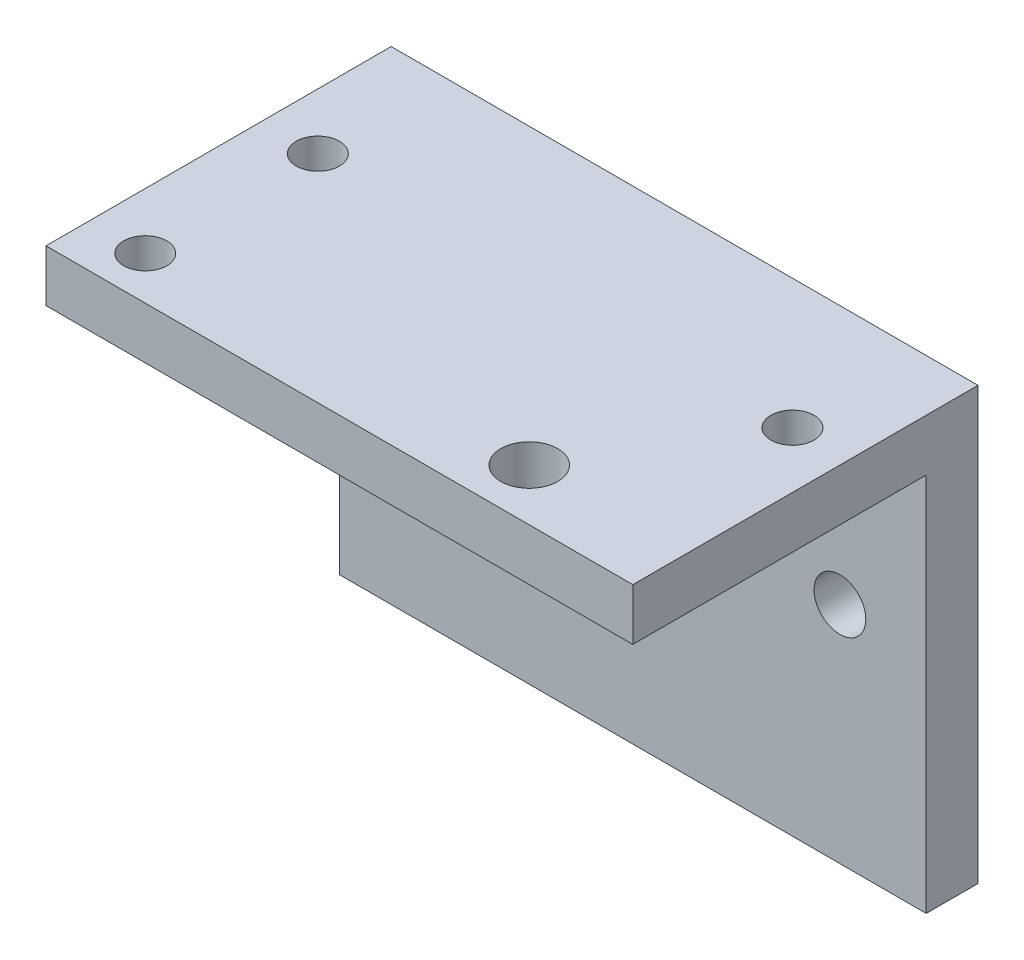
ISO-10303-21;
HEADER;
FILE_DESCRIPTION(('STEP AP214'),'2;1');
FILE_NAME('part.step','',(''),(''),'','','');
FILE_SCHEMA(('AUTOMOTIVE_DESIGN { 1 0 10303 214 1 1 1 1 }'));
ENDSEC;
DATA;
#1=APPLICATION_CONTEXT('core data for automotive mechanical design processes');
#2=APPLICATION_PROTOCOL_DEFINITION('international standard','automotive_design',2000,#1);
#3=PRODUCT_CONTEXT('',#1,'mechanical');
#4=PRODUCT('Part','Part','',(#3));
#5=PRODUCT_RELATED_PRODUCT_CATEGORY('part','',(#4));
#6=PRODUCT_DEFINITION_FORMATION('','',#4);
#7=PRODUCT_DEFINITION_CONTEXT('part definition',#1,'design');
#8=PRODUCT_DEFINITION('design','',#6,#7);
#9=PRODUCT_DEFINITION_SHAPE('','',#8);
#10=(LENGTH_UNIT() NAMED_UNIT(*) SI_UNIT(.MILLI.,.METRE.));
#11=(NAMED_UNIT(*) PLANE_ANGLE_UNIT() SI_UNIT($,.RADIAN.));
#12=(NAMED_UNIT(*) SI_UNIT($,.STERADIAN.) SOLID_ANGLE_UNIT());
#13=UNCERTAINTY_MEASURE_WITH_UNIT(LENGTH_MEASURE(1.E-05),#10,'distance_accuracy_value','');
#14=(GEOMETRIC_REPRESENTATION_CONTEXT(3) GLOBAL_UNCERTAINTY_ASSIGNED_CONTEXT((#13)) GLOBAL_UNIT_ASSIGNED_CONTEXT((#10,
#11,#12)) REPRESENTATION_CONTEXT('',''));
#15=CARTESIAN_POINT('',(0.,0.,0.));
#16=DIRECTION('',(0.,0.,1.));
#17=DIRECTION('',(1.,0.,0.));
#18=AXIS2_PLACEMENT_3D('',#15,#16,#17);
#19=CARTESIAN_POINT('',(0.,6.,0.));
#20=DIRECTION('',(0.,1.,0.));
#21=DIRECTION('',(0.,0.,1.));
#22=AXIS2_PLACEMENT_3D('',#19,#20,#21);
#23=PLANE('',#22);
#24=CARTESIAN_POINT('',(15.9999999984184,6.,-6.00000000001227));
#25=DIRECTION('',(0.,1.,0.));
#26=DIRECTION('',(0.,0.,1.));
#27=AXIS2_PLACEMENT_3D('',#24,#25,#26);
#28=CIRCLE('',#27,3.3);
#29=CARTESIAN_POINT('',(15.9999999984184,6.,-2.70000000001227));
#30=VERTEX_POINT('',#29);
#31=EDGE_CURVE('E226',#30,#30,#28,.T.);
#32=ORIENTED_EDGE('',*,*,#31,.F.);
#33=EDGE_LOOP('',(#32));
#34=FACE_BOUND('',#33,.T.);
#35=DIRECTION('',(0.,0.,-1.));
#36=VECTOR('',#35,1.);
#37=CARTESIAN_POINT('',(34.,6.,-40.));
#38=LINE('',#37,#36);
#39=CARTESIAN_POINT('',(34.,6.,0.));
#40=VERTEX_POINT('',#39);
#41=CARTESIAN_POINT('',(34.,6.,-40.));
#42=VERTEX_POINT('',#41);
#43=EDGE_CURVE('E150',#40,#42,#38,.T.);
#44=ORIENTED_EDGE('',*,*,#43,.T.);
#45=DIRECTION('',(-1.,0.,0.));
#46=VECTOR('',#45,1.);
#47=CARTESIAN_POINT('',(-34.,6.,-40.));
#48=LINE('',#47,#46);
#49=CARTESIAN_POINT('',(-34.,6.,-40.));
#50=VERTEX_POINT('',#49);
#51=EDGE_CURVE('E59',#42,#50,#48,.T.);
#52=ORIENTED_EDGE('',*,*,#51,.T.);
#53=DIRECTION('',(0.,0.,1.));
#54=VECTOR('',#53,1.);
#55=CARTESIAN_POINT('',(-34.,6.,-40.));
#56=LINE('',#55,#54);
#57=CARTESIAN_POINT('',(-34.,6.,0.));
#58=VERTEX_POINT('',#57);
#59=EDGE_CURVE('E79',#50,#58,#56,.T.);
#60=ORIENTED_EDGE('',*,*,#59,.T.);
#61=DIRECTION('',(1.,0.,0.));
#62=VECTOR('',#61,1.);
#63=CARTESIAN_POINT('',(-34.,6.,0.));
#64=LINE('',#63,#62);
#65=EDGE_CURVE('E147',#58,#40,#64,.T.);
#66=ORIENTED_EDGE('',*,*,#65,.T.);
#67=EDGE_LOOP('',(#44,#52,#60,#66));
#68=FACE_BOUND('',#67,.T.);
#69=CARTESIAN_POINT('',(27.5,6.,-25.));
#70=DIRECTION('',(0.,1.,0.));
#71=DIRECTION('',(0.,0.,1.));
#72=AXIS2_PLACEMENT_3D('',#69,#70,#71);
#73=CIRCLE('',#72,2.49999999999999);
#74=CARTESIAN_POINT('',(27.5,6.,-22.5));
#75=VERTEX_POINT('',#74);
#76=EDGE_CURVE('E134',#75,#75,#73,.T.);
#77=ORIENTED_EDGE('',*,*,#76,.F.);
#78=EDGE_LOOP('',(#77));
#79=FACE_BOUND('',#78,.T.);
#80=CARTESIAN_POINT('',(-27.5,6.,-25.));
#81=DIRECTION('',(0.,1.,0.));
#82=DIRECTION('',(0.,0.,1.));
#83=AXIS2_PLACEMENT_3D('',#80,#81,#82);
#84=CIRCLE('',#83,2.5);
#85=CARTESIAN_POINT('',(-27.5,6.,-22.5));
#86=VERTEX_POINT('',#85);
#87=EDGE_CURVE('E140',#86,#86,#84,.T.);
#88=ORIENTED_EDGE('',*,*,#87,.F.);
#89=EDGE_LOOP('',(#88));
#90=FACE_BOUND('',#89,.T.);
#91=CARTESIAN_POINT('',(-27.5,6.,-5.));
#92=DIRECTION('',(0.,1.,0.));
#93=DIRECTION('',(0.,0.,1.));
#94=AXIS2_PLACEMENT_3D('',#91,#92,#93);
#95=CIRCLE('',#94,2.5);
#96=CARTESIAN_POINT('',(-27.5,6.,-2.5));
#97=VERTEX_POINT('',#96);
#98=EDGE_CURVE('E128',#97,#97,#95,.T.);
#99=ORIENTED_EDGE('',*,*,#98,.F.);
#100=EDGE_LOOP('',(#99));
#101=FACE_BOUND('',#100,.T.);
#102=ADVANCED_FACE('F35',(#34,#68,#79,#90,#101),#23,.T.);
#103=CARTESIAN_POINT('',(0.,0.,0.));
#104=DIRECTION('',(0.,1.,0.));
#105=DIRECTION('',(0.,0.,1.));
#106=AXIS2_PLACEMENT_3D('',#103,#104,#105);
#107=PLANE('',#106);
#108=CARTESIAN_POINT('',(15.9999999984184,0.,-6.00000000001227));
#109=DIRECTION('',(0.,-1.,0.));
#110=DIRECTION('',(0.,0.,-1.));
#111=AXIS2_PLACEMENT_3D('',#108,#109,#110);
#112=CIRCLE('',#111,3.3);
#113=CARTESIAN_POINT('',(15.9999999984184,0.,-9.30000000001227));
#114=VERTEX_POINT('',#113);
#115=EDGE_CURVE('E229',#114,#114,#112,.T.);
#116=ORIENTED_EDGE('',*,*,#115,.F.);
#117=EDGE_LOOP('',(#116));
#118=FACE_BOUND('',#117,.T.);
#119=CARTESIAN_POINT('',(27.5,0.,-25.));
#120=DIRECTION('',(0.,1.,0.));
#121=DIRECTION('',(0.,0.,1.));
#122=AXIS2_PLACEMENT_3D('',#119,#120,#121);
#123=CIRCLE('',#122,2.49999999999999);
#124=CARTESIAN_POINT('',(27.5,0.,-22.5));
#125=VERTEX_POINT('',#124);
#126=EDGE_CURVE('E131',#125,#125,#123,.T.);
#127=ORIENTED_EDGE('',*,*,#126,.T.);
#128=EDGE_LOOP('',(#127));
#129=FACE_BOUND('',#128,.T.);
#130=DIRECTION('',(0.,0.,1.));
#131=VECTOR('',#130,1.);
#132=CARTESIAN_POINT('',(-34.,0.,-40.));
#133=LINE('',#132,#131);
#134=CARTESIAN_POINT('',(-34.,0.,-34.));
#135=VERTEX_POINT('',#134);
#136=CARTESIAN_POINT('',(-34.,0.,0.));
#137=VERTEX_POINT('',#136);
#138=EDGE_CURVE('E143',#135,#137,#133,.T.);
#139=ORIENTED_EDGE('',*,*,#138,.F.);
#140=DIRECTION('',(1.,0.,0.));
#141=VECTOR('',#140,1.);
#142=CARTESIAN_POINT('',(0.,0.,-34.));
#143=LINE('',#142,#141);
#144=CARTESIAN_POINT('',(34.,0.,-34.));
#145=VERTEX_POINT('',#144);
#146=EDGE_CURVE('E98',#135,#145,#143,.T.);
#147=ORIENTED_EDGE('',*,*,#146,.T.);
#148=DIRECTION('',(0.,0.,-1.));
#149=VECTOR('',#148,1.);
#150=CARTESIAN_POINT('',(34.,0.,-40.));
#151=LINE('',#150,#149);
#152=CARTESIAN_POINT('',(34.,0.,0.));
#153=VERTEX_POINT('',#152);
#154=EDGE_CURVE('E148',#153,#145,#151,.T.);
#155=ORIENTED_EDGE('',*,*,#154,.F.);
#156=DIRECTION('',(1.,0.,0.));
#157=VECTOR('',#156,1.);
#158=CARTESIAN_POINT('',(-34.,0.,0.));
#159=LINE('',#158,#157);
#160=EDGE_CURVE('E74',#137,#153,#159,.T.);
#161=ORIENTED_EDGE('',*,*,#160,.F.);
#162=EDGE_LOOP('',(#139,#147,#155,#161));
#163=FACE_BOUND('',#162,.T.);
#164=CARTESIAN_POINT('',(-27.5,0.,-25.));
#165=DIRECTION('',(0.,1.,0.));
#166=DIRECTION('',(0.,0.,1.));
#167=AXIS2_PLACEMENT_3D('',#164,#165,#166);
#168=CIRCLE('',#167,2.5);
#169=CARTESIAN_POINT('',(-27.5,0.,-22.5));
#170=VERTEX_POINT('',#169);
#171=EDGE_CURVE('E137',#170,#170,#168,.T.);
#172=ORIENTED_EDGE('',*,*,#171,.T.);
#173=EDGE_LOOP('',(#172));
#174=FACE_BOUND('',#173,.T.);
#175=CARTESIAN_POINT('',(-27.5,0.,-5.));
#176=DIRECTION('',(0.,1.,0.));
#177=DIRECTION('',(0.,0.,1.));
#178=AXIS2_PLACEMENT_3D('',#175,#176,#177);
#179=CIRCLE('',#178,2.5);
#180=CARTESIAN_POINT('',(-27.5,0.,-2.5));
#181=VERTEX_POINT('',#180);
#182=EDGE_CURVE('E127',#181,#181,#179,.T.);
#183=ORIENTED_EDGE('',*,*,#182,.T.);
#184=EDGE_LOOP('',(#183));
#185=FACE_BOUND('',#184,.T.);
#186=ADVANCED_FACE('F165',(#118,#129,#163,#174,#185),#107,.F.);
#187=CARTESIAN_POINT('',(-34.,6.,-40.));
#188=DIRECTION('',(1.,0.,0.));
#189=DIRECTION('',(0.,0.,-1.));
#190=AXIS2_PLACEMENT_3D('',#187,#188,#189);
#191=PLANE('',#190);
#192=DIRECTION('',(0.,-1.,0.));
#193=VECTOR('',#192,1.);
#194=CARTESIAN_POINT('',(-34.,6.,0.));
#195=LINE('',#194,#193);
#196=EDGE_CURVE('E11',#58,#137,#195,.T.);
#197=ORIENTED_EDGE('',*,*,#196,.F.);
#198=ORIENTED_EDGE('',*,*,#59,.F.);
#199=DIRECTION('',(0.,-1.,0.));
#200=VECTOR('',#199,1.);
#201=CARTESIAN_POINT('',(-34.,6.,-40.));
#202=LINE('',#201,#200);
#203=CARTESIAN_POINT('',(-34.,-44.,-40.));
#204=VERTEX_POINT('',#203);
#205=EDGE_CURVE('E115',#50,#204,#202,.T.);
#206=ORIENTED_EDGE('',*,*,#205,.T.);
#207=DIRECTION('',(0.,0.,1.));
#208=VECTOR('',#207,1.);
#209=CARTESIAN_POINT('',(-34.,-44.,-40.));
#210=LINE('',#209,#208);
#211=CARTESIAN_POINT('',(-34.,-44.,-34.));
#212=VERTEX_POINT('',#211);
#213=EDGE_CURVE('E109',#204,#212,#210,.T.);
#214=ORIENTED_EDGE('',*,*,#213,.T.);
#215=DIRECTION('',(0.,1.,0.));
#216=VECTOR('',#215,1.);
#217=CARTESIAN_POINT('',(-34.,-44.,-34.));
#218=LINE('',#217,#216);
#219=EDGE_CURVE('E94',#212,#135,#218,.T.);
#220=ORIENTED_EDGE('',*,*,#219,.T.);
#221=ORIENTED_EDGE('',*,*,#138,.T.);
#222=EDGE_LOOP('',(#197,#198,#206,#214,#220,#221));
#223=FACE_BOUND('',#222,.T.);
#224=ADVANCED_FACE('F37',(#223),#191,.F.);
#225=CARTESIAN_POINT('',(-34.,6.,0.));
#226=DIRECTION('',(0.,0.,-1.));
#227=DIRECTION('',(-1.,0.,0.));
#228=AXIS2_PLACEMENT_3D('',#225,#226,#227);
#229=PLANE('',#228);
#230=ORIENTED_EDGE('',*,*,#160,.T.);
#231=DIRECTION('',(0.,-1.,0.));
#232=VECTOR('',#231,1.);
#233=CARTESIAN_POINT('',(34.,6.,0.));
#234=LINE('',#233,#232);
#235=EDGE_CURVE('E43',#40,#153,#234,.T.);
#236=ORIENTED_EDGE('',*,*,#235,.F.);
#237=ORIENTED_EDGE('',*,*,#65,.F.);
#238=ORIENTED_EDGE('',*,*,#196,.T.);
#239=EDGE_LOOP('',(#230,#236,#237,#238));
#240=FACE_BOUND('',#239,.T.);
#241=ADVANCED_FACE('F167',(#240),#229,.F.);
#242=CARTESIAN_POINT('',(34.,6.,-40.));
#243=DIRECTION('',(-1.,0.,0.));
#244=DIRECTION('',(0.,0.,1.));
#245=AXIS2_PLACEMENT_3D('',#242,#243,#244);
#246=PLANE('',#245);
#247=ORIENTED_EDGE('',*,*,#154,.T.);
#248=DIRECTION('',(0.,1.,0.));
#249=VECTOR('',#248,1.);
#250=CARTESIAN_POINT('',(34.,-44.,-34.));
#251=LINE('',#250,#249);
#252=CARTESIAN_POINT('',(34.,-44.,-34.));
#253=VERTEX_POINT('',#252);
#254=EDGE_CURVE('E50',#253,#145,#251,.T.);
#255=ORIENTED_EDGE('',*,*,#254,.F.);
#256=DIRECTION('',(0.,0.,-1.));
#257=VECTOR('',#256,1.);
#258=CARTESIAN_POINT('',(34.,-44.,-40.));
#259=LINE('',#258,#257);
#260=CARTESIAN_POINT('',(34.,-44.,-40.));
#261=VERTEX_POINT('',#260);
#262=EDGE_CURVE('E112',#253,#261,#259,.T.);
#263=ORIENTED_EDGE('',*,*,#262,.T.);
#264=DIRECTION('',(0.,-1.,0.));
#265=VECTOR('',#264,1.);
#266=CARTESIAN_POINT('',(34.,6.,-40.));
#267=LINE('',#266,#265);
#268=EDGE_CURVE('E158',#42,#261,#267,.T.);
#269=ORIENTED_EDGE('',*,*,#268,.F.);
#270=ORIENTED_EDGE('',*,*,#43,.F.);
#271=ORIENTED_EDGE('',*,*,#235,.T.);
#272=EDGE_LOOP('',(#247,#255,#263,#269,#270,#271));
#273=FACE_BOUND('',#272,.T.);
#274=ADVANCED_FACE('F162',(#273),#246,.F.);
#275=CARTESIAN_POINT('',(-34.,6.,-40.));
#276=DIRECTION('',(0.,0.,1.));
#277=DIRECTION('',(1.,0.,0.));
#278=AXIS2_PLACEMENT_3D('',#275,#276,#277);
#279=PLANE('',#278);
#280=CARTESIAN_POINT('',(-24.,-18.,-40.));
#281=DIRECTION('',(0.,0.,1.));
#282=DIRECTION('',(1.,0.,0.));
#283=AXIS2_PLACEMENT_3D('',#280,#281,#282);
#284=CIRCLE('',#283,3.);
#285=CARTESIAN_POINT('',(-21.,-18.,-40.));
#286=VERTEX_POINT('',#285);
#287=EDGE_CURVE('E236',#286,#286,#284,.F.);
#288=ORIENTED_EDGE('',*,*,#287,.F.);
#289=EDGE_LOOP('',(#288));
#290=FACE_BOUND('',#289,.T.);
#291=CARTESIAN_POINT('',(24.,-18.,-40.));
#292=DIRECTION('',(0.,0.,1.));
#293=DIRECTION('',(1.,0.,0.));
#294=AXIS2_PLACEMENT_3D('',#291,#292,#293);
#295=CIRCLE('',#294,3.);
#296=CARTESIAN_POINT('',(27.,-18.,-40.));
#297=VERTEX_POINT('',#296);
#298=EDGE_CURVE('E242',#297,#297,#295,.F.);
#299=ORIENTED_EDGE('',*,*,#298,.F.);
#300=EDGE_LOOP('',(#299));
#301=FACE_BOUND('',#300,.T.);
#302=CARTESIAN_POINT('',(0.,-18.,-40.));
#303=DIRECTION('',(0.,0.,1.));
#304=DIRECTION('',(1.,0.,0.));
#305=AXIS2_PLACEMENT_3D('',#302,#303,#304);
#306=CIRCLE('',#305,8.);
#307=CARTESIAN_POINT('',(8.,-18.,-40.));
#308=VERTEX_POINT('',#307);
#309=EDGE_CURVE('E116',#308,#308,#306,.F.);
#310=ORIENTED_EDGE('',*,*,#309,.F.);
#311=EDGE_LOOP('',(#310));
#312=FACE_BOUND('',#311,.T.);
#313=ORIENTED_EDGE('',*,*,#268,.T.);
#314=DIRECTION('',(-1.,0.,0.));
#315=VECTOR('',#314,1.);
#316=CARTESIAN_POINT('',(-34.,-44.,-40.));
#317=LINE('',#316,#315);
#318=EDGE_CURVE('E102',#261,#204,#317,.T.);
#319=ORIENTED_EDGE('',*,*,#318,.T.);
#320=ORIENTED_EDGE('',*,*,#205,.F.);
#321=ORIENTED_EDGE('',*,*,#51,.F.);
#322=EDGE_LOOP('',(#313,#319,#320,#321));
#323=FACE_BOUND('',#322,.T.);
#324=ADVANCED_FACE('F170',(#290,#301,#312,#323),#279,.F.);
#325=CARTESIAN_POINT('',(-27.5,6.,-25.));
#326=DIRECTION('',(0.,-1.,0.));
#327=DIRECTION('',(0.,0.,-1.));
#328=AXIS2_PLACEMENT_3D('',#325,#326,#327);
#329=CYLINDRICAL_SURFACE('',#328,2.5);
#330=ORIENTED_EDGE('',*,*,#87,.T.);
#331=EDGE_LOOP('',(#330));
#332=FACE_BOUND('',#331,.T.);
#333=ORIENTED_EDGE('',*,*,#171,.F.);
#334=EDGE_LOOP('',(#333));
#335=FACE_BOUND('',#334,.T.);
#336=ADVANCED_FACE('F172',(#332,#335),#329,.F.);
#337=CARTESIAN_POINT('',(27.5,6.,-25.));
#338=DIRECTION('',(0.,-1.,0.));
#339=DIRECTION('',(0.,0.,-1.));
#340=AXIS2_PLACEMENT_3D('',#337,#338,#339);
#341=CYLINDRICAL_SURFACE('',#340,2.49999999999999);
#342=ORIENTED_EDGE('',*,*,#76,.T.);
#343=EDGE_LOOP('',(#342));
#344=FACE_BOUND('',#343,.T.);
#345=ORIENTED_EDGE('',*,*,#126,.F.);
#346=EDGE_LOOP('',(#345));
#347=FACE_BOUND('',#346,.T.);
#348=ADVANCED_FACE('F179',(#344,#347),#341,.F.);
#349=CARTESIAN_POINT('',(-27.5,6.,-5.));
#350=DIRECTION('',(0.,-1.,0.));
#351=DIRECTION('',(0.,0.,-1.));
#352=AXIS2_PLACEMENT_3D('',#349,#350,#351);
#353=CYLINDRICAL_SURFACE('',#352,2.5);
#354=ORIENTED_EDGE('',*,*,#98,.T.);
#355=EDGE_LOOP('',(#354));
#356=FACE_BOUND('',#355,.T.);
#357=ORIENTED_EDGE('',*,*,#182,.F.);
#358=EDGE_LOOP('',(#357));
#359=FACE_BOUND('',#358,.T.);
#360=ADVANCED_FACE('F197',(#356,#359),#353,.F.);
#361=CARTESIAN_POINT('',(-34.,-44.,-34.));
#362=DIRECTION('',(0.,0.,1.));
#363=DIRECTION('',(1.,0.,0.));
#364=AXIS2_PLACEMENT_3D('',#361,#362,#363);
#365=PLANE('',#364);
#366=CARTESIAN_POINT('',(-24.,-18.,-34.));
#367=DIRECTION('',(0.,0.,1.));
#368=DIRECTION('',(-1.,0.,0.));
#369=AXIS2_PLACEMENT_3D('',#366,#367,#368);
#370=CIRCLE('',#369,3.);
#371=CARTESIAN_POINT('',(-27.,-18.,-34.));
#372=VERTEX_POINT('',#371);
#373=EDGE_CURVE('E231',#372,#372,#370,.T.);
#374=ORIENTED_EDGE('',*,*,#373,.F.);
#375=EDGE_LOOP('',(#374));
#376=FACE_BOUND('',#375,.T.);
#377=CARTESIAN_POINT('',(24.,-18.,-34.));
#378=DIRECTION('',(0.,0.,1.));
#379=DIRECTION('',(1.,0.,0.));
#380=AXIS2_PLACEMENT_3D('',#377,#378,#379);
#381=CIRCLE('',#380,3.);
#382=CARTESIAN_POINT('',(27.,-18.,-34.));
#383=VERTEX_POINT('',#382);
#384=EDGE_CURVE('E239',#383,#383,#381,.T.);
#385=ORIENTED_EDGE('',*,*,#384,.F.);
#386=EDGE_LOOP('',(#385));
#387=FACE_BOUND('',#386,.T.);
#388=CARTESIAN_POINT('',(0.,-18.,-34.));
#389=DIRECTION('',(0.,0.,1.));
#390=DIRECTION('',(1.,0.,0.));
#391=AXIS2_PLACEMENT_3D('',#388,#389,#390);
#392=CIRCLE('',#391,8.);
#393=CARTESIAN_POINT('',(8.,-18.,-34.));
#394=VERTEX_POINT('',#393);
#395=EDGE_CURVE('E119',#394,#394,#392,.T.);
#396=ORIENTED_EDGE('',*,*,#395,.F.);
#397=EDGE_LOOP('',(#396));
#398=FACE_BOUND('',#397,.T.);
#399=ORIENTED_EDGE('',*,*,#146,.F.);
#400=ORIENTED_EDGE('',*,*,#219,.F.);
#401=DIRECTION('',(1.,0.,0.));
#402=VECTOR('',#401,1.);
#403=CARTESIAN_POINT('',(-34.,-44.,-34.));
#404=LINE('',#403,#402);
#405=EDGE_CURVE('E97',#212,#253,#404,.T.);
#406=ORIENTED_EDGE('',*,*,#405,.T.);
#407=ORIENTED_EDGE('',*,*,#254,.T.);
#408=EDGE_LOOP('',(#399,#400,#406,#407));
#409=FACE_BOUND('',#408,.T.);
#410=ADVANCED_FACE('F96',(#376,#387,#398,#409),#365,.T.);
#411=CARTESIAN_POINT('',(0.,-44.,0.));
#412=DIRECTION('',(0.,1.,0.));
#413=DIRECTION('',(0.,0.,1.));
#414=AXIS2_PLACEMENT_3D('',#411,#412,#413);
#415=PLANE('',#414);
#416=ORIENTED_EDGE('',*,*,#213,.F.);
#417=ORIENTED_EDGE('',*,*,#318,.F.);
#418=ORIENTED_EDGE('',*,*,#262,.F.);
#419=ORIENTED_EDGE('',*,*,#405,.F.);
#420=EDGE_LOOP('',(#416,#417,#418,#419));
#421=FACE_BOUND('',#420,.T.);
#422=ADVANCED_FACE('F107',(#421),#415,.F.);
#423=CARTESIAN_POINT('',(0.,-18.,-40.001));
#424=DIRECTION('',(0.,0.,1.));
#425=DIRECTION('',(1.,0.,0.));
#426=AXIS2_PLACEMENT_3D('',#423,#424,#425);
#427=CYLINDRICAL_SURFACE('',#426,8.);
#428=ORIENTED_EDGE('',*,*,#395,.T.);
#429=EDGE_LOOP('',(#428));
#430=FACE_BOUND('',#429,.T.);
#431=ORIENTED_EDGE('',*,*,#309,.T.);
#432=EDGE_LOOP('',(#431));
#433=FACE_BOUND('',#432,.T.);
#434=ADVANCED_FACE('F207',(#430,#433),#427,.F.);
#435=CARTESIAN_POINT('',(24.,-18.,-40.001));
#436=DIRECTION('',(0.,0.,1.));
#437=DIRECTION('',(1.,0.,0.));
#438=AXIS2_PLACEMENT_3D('',#435,#436,#437);
#439=CYLINDRICAL_SURFACE('',#438,3.);
#440=ORIENTED_EDGE('',*,*,#384,.T.);
#441=EDGE_LOOP('',(#440));
#442=FACE_BOUND('',#441,.T.);
#443=ORIENTED_EDGE('',*,*,#298,.T.);
#444=EDGE_LOOP('',(#443));
#445=FACE_BOUND('',#444,.T.);
#446=ADVANCED_FACE('F210',(#442,#445),#439,.F.);
#447=CARTESIAN_POINT('',(-24.,-18.,-40.001));
#448=DIRECTION('',(0.,0.,1.));
#449=DIRECTION('',(1.,0.,0.));
#450=AXIS2_PLACEMENT_3D('',#447,#448,#449);
#451=CYLINDRICAL_SURFACE('',#450,3.);
#452=ORIENTED_EDGE('',*,*,#373,.T.);
#453=EDGE_LOOP('',(#452));
#454=FACE_BOUND('',#453,.T.);
#455=ORIENTED_EDGE('',*,*,#287,.T.);
#456=EDGE_LOOP('',(#455));
#457=FACE_BOUND('',#456,.T.);
#458=ADVANCED_FACE('F214',(#454,#457),#451,.F.);
#459=CARTESIAN_POINT('',(15.9999999984184,10.,-6.00000000001227));
#460=DIRECTION('',(0.,-1.,0.));
#461=DIRECTION('',(0.,0.,-1.));
#462=AXIS2_PLACEMENT_3D('',#459,#460,#461);
#463=CYLINDRICAL_SURFACE('',#462,3.3);
#464=ORIENTED_EDGE('',*,*,#31,.T.);
#465=EDGE_LOOP('',(#464));
#466=FACE_BOUND('',#465,.T.);
#467=ORIENTED_EDGE('',*,*,#115,.T.);
#468=EDGE_LOOP('',(#467));
#469=FACE_BOUND('',#468,.T.);
#470=ADVANCED_FACE('F218',(#466,#469),#463,.F.);
#471=CLOSED_SHELL('',(#102,#186,#224,#241,#274,#324,#336,#348,#360,#410,#422,#434,#446,#458,#470));
#472=MANIFOLD_SOLID_BREP('B2',#471);
#473=ADVANCED_BREP_SHAPE_REPRESENTATION('',(#18,#472),#14);
#474=SHAPE_DEFINITION_REPRESENTATION(#9,#473);
ENDSEC;
END-ISO-10303-21;
